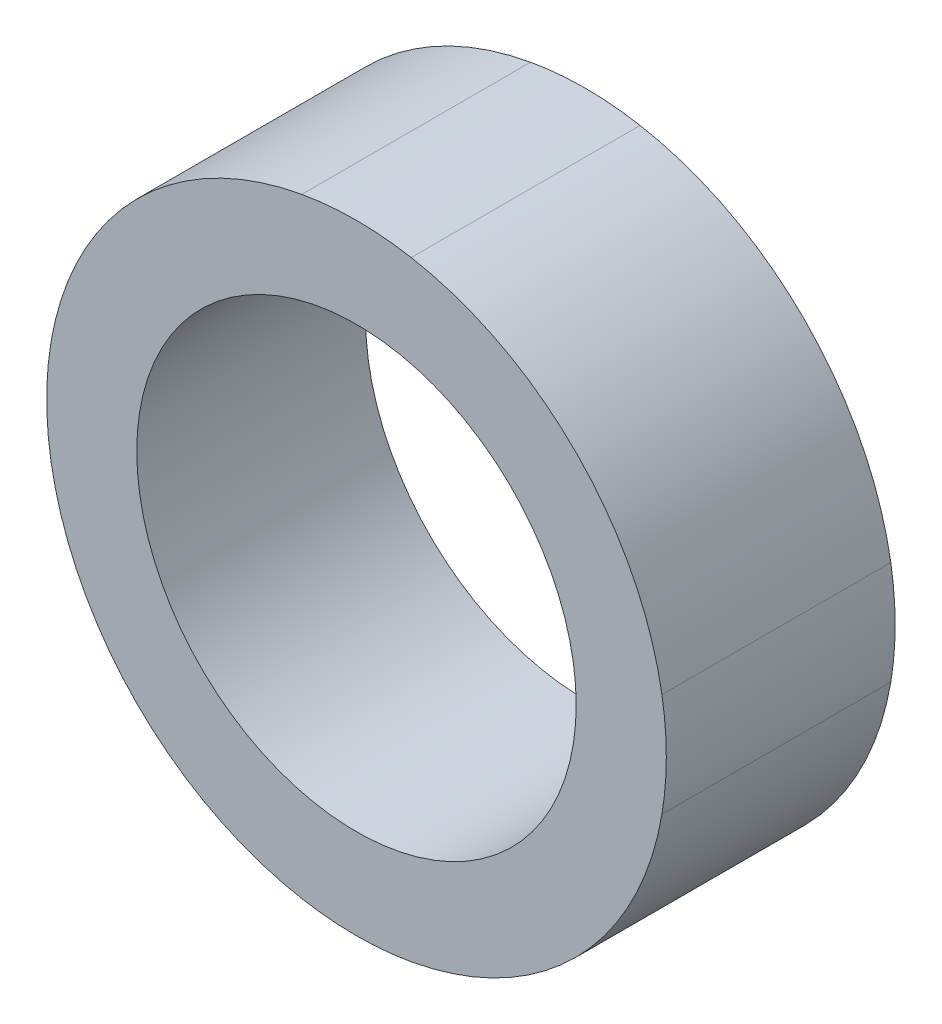
ISO-10303-21;
HEADER;
FILE_DESCRIPTION(('STEP AP214'),'2;1');
FILE_NAME('part.step','',(''),(''),'','','');
FILE_SCHEMA(('AUTOMOTIVE_DESIGN { 1 0 10303 214 1 1 1 1 }'));
ENDSEC;
DATA;
#1=APPLICATION_CONTEXT('core data for automotive mechanical design processes');
#2=APPLICATION_PROTOCOL_DEFINITION('international standard','automotive_design',2000,#1);
#3=PRODUCT_CONTEXT('',#1,'mechanical');
#4=PRODUCT('Part','Part','',(#3));
#5=PRODUCT_RELATED_PRODUCT_CATEGORY('part','',(#4));
#6=PRODUCT_DEFINITION_FORMATION('','',#4);
#7=PRODUCT_DEFINITION_CONTEXT('part definition',#1,'design');
#8=PRODUCT_DEFINITION('design','',#6,#7);
#9=PRODUCT_DEFINITION_SHAPE('','',#8);
#10=(LENGTH_UNIT() NAMED_UNIT(*) SI_UNIT(.MILLI.,.METRE.));
#11=(NAMED_UNIT(*) PLANE_ANGLE_UNIT() SI_UNIT($,.RADIAN.));
#12=(NAMED_UNIT(*) SI_UNIT($,.STERADIAN.) SOLID_ANGLE_UNIT());
#13=UNCERTAINTY_MEASURE_WITH_UNIT(LENGTH_MEASURE(1.E-05),#10,'distance_accuracy_value','');
#14=(GEOMETRIC_REPRESENTATION_CONTEXT(3) GLOBAL_UNCERTAINTY_ASSIGNED_CONTEXT((#13)) GLOBAL_UNIT_ASSIGNED_CONTEXT((#10,
#11,#12)) REPRESENTATION_CONTEXT('',''));
#15=CARTESIAN_POINT('',(0.,0.,0.));
#16=DIRECTION('',(0.,0.,1.));
#17=DIRECTION('',(1.,0.,0.));
#18=AXIS2_PLACEMENT_3D('',#15,#16,#17);
#19=CARTESIAN_POINT('',(0.,0.,4.7752));
#20=DIRECTION('',(0.,0.,-1.));
#21=DIRECTION('',(-1.,0.,0.));
#22=AXIS2_PLACEMENT_3D('',#19,#20,#21);
#23=CYLINDRICAL_SURFACE('',#22,6.4643);
#24=DIRECTION('',(0.,0.,-1.));
#25=VECTOR('',#24,1.);
#26=CARTESIAN_POINT('',(-1.14211907193711,-6.3626046958394,4.7752));
#27=LINE('',#26,#25);
#28=CARTESIAN_POINT('',(-1.14211907193711,-6.3626046958394,4.7752));
#29=VERTEX_POINT('',#28);
#30=CARTESIAN_POINT('',(-1.14211907193711,-6.3626046958394,0.));
#31=VERTEX_POINT('',#30);
#32=EDGE_CURVE('E11',#29,#31,#27,.T.);
#33=ORIENTED_EDGE('',*,*,#32,.F.);
#34=CARTESIAN_POINT('',(0.,0.,4.7752));
#35=DIRECTION('',(0.,0.,1.));
#36=DIRECTION('',(1.,0.,0.));
#37=AXIS2_PLACEMENT_3D('',#34,#35,#36);
#38=CIRCLE('',#37,6.4643);
#39=CARTESIAN_POINT('',(-6.37329301845677,-1.08088417089447,4.7752));
#40=VERTEX_POINT('',#39);
#41=EDGE_CURVE('E132',#40,#29,#38,.T.);
#42=ORIENTED_EDGE('',*,*,#41,.F.);
#43=DIRECTION('',(0.,0.,-1.));
#44=VECTOR('',#43,1.);
#45=CARTESIAN_POINT('',(-6.37329301845677,-1.08088417089447,4.7752));
#46=LINE('',#45,#44);
#47=CARTESIAN_POINT('',(-6.37329301845677,-1.08088417089447,0.));
#48=VERTEX_POINT('',#47);
#49=EDGE_CURVE('E138',#48,#40,#46,.F.);
#50=ORIENTED_EDGE('',*,*,#49,.F.);
#51=CARTESIAN_POINT('',(0.,0.,0.));
#52=DIRECTION('',(0.,0.,1.));
#53=DIRECTION('',(1.,0.,0.));
#54=AXIS2_PLACEMENT_3D('',#51,#52,#53);
#55=CIRCLE('',#54,6.4643);
#56=EDGE_CURVE('E172',#48,#31,#55,.T.);
#57=ORIENTED_EDGE('',*,*,#56,.T.);
#58=EDGE_LOOP('',(#33,#42,#50,#57));
#59=FACE_BOUND('',#58,.T.);
#60=ADVANCED_FACE('F48',(#59),#23,.T.);
#61=DIRECTION('',(0.,0.,-1.));
#62=VECTOR('',#61,1.);
#63=CARTESIAN_POINT('',(1.14211907193711,-6.3626046958394,4.7752));
#64=LINE('',#63,#62);
#65=CARTESIAN_POINT('',(1.14211907193711,-6.3626046958394,0.));
#66=VERTEX_POINT('',#65);
#67=CARTESIAN_POINT('',(1.14211907193711,-6.3626046958394,4.7752));
#68=VERTEX_POINT('',#67);
#69=EDGE_CURVE('E57',#66,#68,#64,.F.);
#70=ORIENTED_EDGE('',*,*,#69,.F.);
#71=CARTESIAN_POINT('',(6.37329301845677,-1.08088417089447,0.));
#72=VERTEX_POINT('',#71);
#73=EDGE_CURVE('E178',#66,#72,#55,.T.);
#74=ORIENTED_EDGE('',*,*,#73,.T.);
#75=DIRECTION('',(0.,0.,-1.));
#76=VECTOR('',#75,1.);
#77=CARTESIAN_POINT('',(6.37329301845677,-1.08088417089447,4.7752));
#78=LINE('',#77,#76);
#79=CARTESIAN_POINT('',(6.37329301845677,-1.08088417089447,4.7752));
#80=VERTEX_POINT('',#79);
#81=EDGE_CURVE('E142',#80,#72,#78,.T.);
#82=ORIENTED_EDGE('',*,*,#81,.F.);
#83=EDGE_CURVE('E125',#68,#80,#38,.T.);
#84=ORIENTED_EDGE('',*,*,#83,.F.);
#85=EDGE_LOOP('',(#70,#74,#82,#84));
#86=FACE_BOUND('',#85,.T.);
#87=ADVANCED_FACE('F177',(#86),#23,.T.);
#88=DIRECTION('',(0.,0.,-1.));
#89=VECTOR('',#88,1.);
#90=CARTESIAN_POINT('',(1.1421190719371,6.3626046958394,4.7752));
#91=LINE('',#90,#89);
#92=CARTESIAN_POINT('',(1.1421190719371,6.3626046958394,4.7752));
#93=VERTEX_POINT('',#92);
#94=CARTESIAN_POINT('',(1.1421190719371,6.3626046958394,0.));
#95=VERTEX_POINT('',#94);
#96=EDGE_CURVE('E176',#93,#95,#91,.T.);
#97=ORIENTED_EDGE('',*,*,#96,.F.);
#98=CARTESIAN_POINT('',(6.37329301845677,1.08088417089447,4.7752));
#99=VERTEX_POINT('',#98);
#100=EDGE_CURVE('E139',#99,#93,#38,.T.);
#101=ORIENTED_EDGE('',*,*,#100,.F.);
#102=DIRECTION('',(0.,0.,-1.));
#103=VECTOR('',#102,1.);
#104=CARTESIAN_POINT('',(6.37329301845677,1.08088417089447,4.7752));
#105=LINE('',#104,#103);
#106=CARTESIAN_POINT('',(6.37329301845677,1.08088417089447,0.));
#107=VERTEX_POINT('',#106);
#108=EDGE_CURVE('E135',#107,#99,#105,.F.);
#109=ORIENTED_EDGE('',*,*,#108,.F.);
#110=EDGE_CURVE('E207',#107,#95,#55,.T.);
#111=ORIENTED_EDGE('',*,*,#110,.T.);
#112=EDGE_LOOP('',(#97,#101,#109,#111));
#113=FACE_BOUND('',#112,.T.);
#114=ADVANCED_FACE('F211',(#113),#23,.T.);
#115=DIRECTION('',(0.,0.,-1.));
#116=VECTOR('',#115,1.);
#117=CARTESIAN_POINT('',(-1.14211907193711,6.3626046958394,4.7752));
#118=LINE('',#117,#116);
#119=CARTESIAN_POINT('',(-1.14211907193711,6.3626046958394,0.));
#120=VERTEX_POINT('',#119);
#121=CARTESIAN_POINT('',(-1.14211907193711,6.3626046958394,4.7752));
#122=VERTEX_POINT('',#121);
#123=EDGE_CURVE('E188',#120,#122,#118,.F.);
#124=ORIENTED_EDGE('',*,*,#123,.F.);
#125=CARTESIAN_POINT('',(-6.37329301845677,1.08088417089447,0.));
#126=VERTEX_POINT('',#125);
#127=EDGE_CURVE('E208',#120,#126,#55,.T.);
#128=ORIENTED_EDGE('',*,*,#127,.T.);
#129=DIRECTION('',(0.,0.,-1.));
#130=VECTOR('',#129,1.);
#131=CARTESIAN_POINT('',(-6.37329301845677,1.08088417089447,4.7752));
#132=LINE('',#131,#130);
#133=CARTESIAN_POINT('',(-6.37329301845677,1.08088417089447,4.7752));
#134=VERTEX_POINT('',#133);
#135=EDGE_CURVE('E166',#134,#126,#132,.T.);
#136=ORIENTED_EDGE('',*,*,#135,.F.);
#137=EDGE_CURVE('E150',#122,#134,#38,.T.);
#138=ORIENTED_EDGE('',*,*,#137,.F.);
#139=EDGE_LOOP('',(#124,#128,#136,#138));
#140=FACE_BOUND('',#139,.T.);
#141=ADVANCED_FACE('F243',(#140),#23,.T.);
#142=EDGE_CURVE('E133',#93,#122,#38,.T.);
#143=ORIENTED_EDGE('',*,*,#142,.F.);
#144=ORIENTED_EDGE('',*,*,#96,.T.);
#145=EDGE_CURVE('E198',#95,#120,#55,.T.);
#146=ORIENTED_EDGE('',*,*,#145,.T.);
#147=ORIENTED_EDGE('',*,*,#123,.T.);
#148=EDGE_LOOP('',(#143,#144,#146,#147));
#149=FACE_BOUND('',#148,.T.);
#150=ADVANCED_FACE('F197',(#149),#23,.T.);
#151=EDGE_CURVE('E144',#134,#40,#38,.T.);
#152=ORIENTED_EDGE('',*,*,#151,.F.);
#153=ORIENTED_EDGE('',*,*,#135,.T.);
#154=EDGE_CURVE('E168',#126,#48,#55,.T.);
#155=ORIENTED_EDGE('',*,*,#154,.T.);
#156=ORIENTED_EDGE('',*,*,#49,.T.);
#157=EDGE_LOOP('',(#152,#153,#155,#156));
#158=FACE_BOUND('',#157,.T.);
#159=ADVANCED_FACE('F164',(#158),#23,.T.);
#160=EDGE_CURVE('E148',#29,#68,#38,.T.);
#161=ORIENTED_EDGE('',*,*,#160,.F.);
#162=ORIENTED_EDGE('',*,*,#32,.T.);
#163=EDGE_CURVE('E174',#31,#66,#55,.T.);
#164=ORIENTED_EDGE('',*,*,#163,.T.);
#165=ORIENTED_EDGE('',*,*,#69,.T.);
#166=EDGE_LOOP('',(#161,#162,#164,#165));
#167=FACE_BOUND('',#166,.T.);
#168=ADVANCED_FACE('F173',(#167),#23,.T.);
#169=CARTESIAN_POINT('',(0.,0.,4.7752));
#170=DIRECTION('',(0.,0.,1.));
#171=DIRECTION('',(1.,0.,0.));
#172=AXIS2_PLACEMENT_3D('',#169,#170,#171);
#173=PLANE('',#172);
#174=CARTESIAN_POINT('',(6.4643,0.,4.7752));
#175=VERTEX_POINT('',#174);
#176=EDGE_CURVE('E123',#175,#99,#38,.T.);
#177=ORIENTED_EDGE('',*,*,#176,.T.);
#178=ORIENTED_EDGE('',*,*,#100,.T.);
#179=ORIENTED_EDGE('',*,*,#142,.T.);
#180=ORIENTED_EDGE('',*,*,#137,.T.);
#181=ORIENTED_EDGE('',*,*,#151,.T.);
#182=ORIENTED_EDGE('',*,*,#41,.T.);
#183=ORIENTED_EDGE('',*,*,#160,.T.);
#184=ORIENTED_EDGE('',*,*,#83,.T.);
#185=EDGE_CURVE('E118',#80,#175,#38,.T.);
#186=ORIENTED_EDGE('',*,*,#185,.T.);
#187=EDGE_LOOP('',(#177,#178,#179,#180,#181,#182,#183,#184,#186));
#188=FACE_BOUND('',#187,.T.);
#189=CARTESIAN_POINT('',(0.,0.,4.7752));
#190=DIRECTION('',(0.,0.,1.));
#191=DIRECTION('',(1.,0.,0.));
#192=AXIS2_PLACEMENT_3D('',#189,#190,#191);
#193=CIRCLE('',#192,4.5847);
#194=CARTESIAN_POINT('',(4.5847,0.,4.7752));
#195=VERTEX_POINT('',#194);
#196=EDGE_CURVE('E219',#195,#195,#193,.T.);
#197=ORIENTED_EDGE('',*,*,#196,.F.);
#198=EDGE_LOOP('',(#197));
#199=FACE_BOUND('',#198,.T.);
#200=ADVANCED_FACE('F120',(#188,#199),#173,.T.);
#201=CARTESIAN_POINT('',(0.,0.,0.));
#202=DIRECTION('',(0.,0.,1.));
#203=DIRECTION('',(1.,0.,0.));
#204=AXIS2_PLACEMENT_3D('',#201,#202,#203);
#205=PLANE('',#204);
#206=CARTESIAN_POINT('',(6.4643,0.,0.));
#207=VERTEX_POINT('',#206);
#208=EDGE_CURVE('E130',#207,#107,#55,.T.);
#209=ORIENTED_EDGE('',*,*,#208,.F.);
#210=EDGE_CURVE('E210',#72,#207,#55,.T.);
#211=ORIENTED_EDGE('',*,*,#210,.F.);
#212=ORIENTED_EDGE('',*,*,#73,.F.);
#213=ORIENTED_EDGE('',*,*,#163,.F.);
#214=ORIENTED_EDGE('',*,*,#56,.F.);
#215=ORIENTED_EDGE('',*,*,#154,.F.);
#216=ORIENTED_EDGE('',*,*,#127,.F.);
#217=ORIENTED_EDGE('',*,*,#145,.F.);
#218=ORIENTED_EDGE('',*,*,#110,.F.);
#219=EDGE_LOOP('',(#209,#211,#212,#213,#214,#215,#216,#217,#218));
#220=FACE_BOUND('',#219,.T.);
#221=CARTESIAN_POINT('',(0.,0.,0.));
#222=DIRECTION('',(0.,0.,1.));
#223=DIRECTION('',(1.,0.,0.));
#224=AXIS2_PLACEMENT_3D('',#221,#222,#223);
#225=CIRCLE('',#224,4.5847);
#226=CARTESIAN_POINT('',(4.5847,0.,0.));
#227=VERTEX_POINT('',#226);
#228=EDGE_CURVE('E223',#227,#227,#225,.T.);
#229=ORIENTED_EDGE('',*,*,#228,.T.);
#230=EDGE_LOOP('',(#229));
#231=FACE_BOUND('',#230,.T.);
#232=ADVANCED_FACE('F205',(#220,#231),#205,.F.);
#233=ORIENTED_EDGE('',*,*,#208,.T.);
#234=ORIENTED_EDGE('',*,*,#108,.T.);
#235=ORIENTED_EDGE('',*,*,#176,.F.);
#236=ORIENTED_EDGE('',*,*,#185,.F.);
#237=ORIENTED_EDGE('',*,*,#81,.T.);
#238=ORIENTED_EDGE('',*,*,#210,.T.);
#239=EDGE_LOOP('',(#233,#234,#235,#236,#237,#238));
#240=FACE_BOUND('',#239,.T.);
#241=ADVANCED_FACE('F50',(#240),#23,.T.);
#242=CARTESIAN_POINT('',(0.,0.,4.7752));
#243=DIRECTION('',(0.,0.,-1.));
#244=DIRECTION('',(-1.,0.,0.));
#245=AXIS2_PLACEMENT_3D('',#242,#243,#244);
#246=CYLINDRICAL_SURFACE('',#245,4.5847);
#247=ORIENTED_EDGE('',*,*,#196,.T.);
#248=EDGE_LOOP('',(#247));
#249=FACE_BOUND('',#248,.T.);
#250=ORIENTED_EDGE('',*,*,#228,.F.);
#251=EDGE_LOOP('',(#250));
#252=FACE_BOUND('',#251,.T.);
#253=ADVANCED_FACE('F231',(#249,#252),#246,.F.);
#254=CLOSED_SHELL('',(#60,#87,#114,#141,#150,#159,#168,#200,#232,#241,#253));
#255=MANIFOLD_SOLID_BREP('B2',#254);
#256=ADVANCED_BREP_SHAPE_REPRESENTATION('',(#18,#255),#14);
#257=SHAPE_DEFINITION_REPRESENTATION(#9,#256);
ENDSEC;
END-ISO-10303-21;
